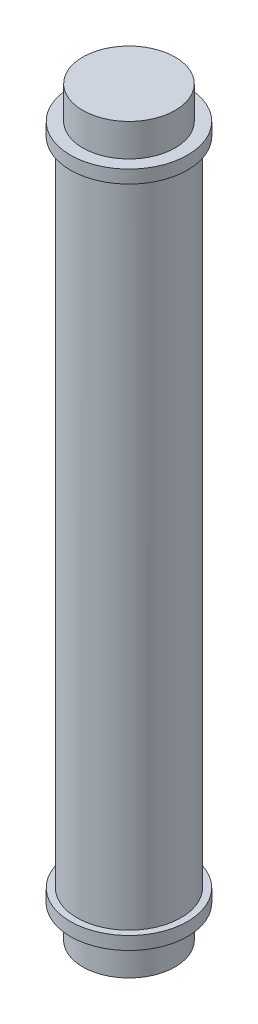
ISO-10303-21;
HEADER;
FILE_DESCRIPTION(('STEP AP214'),'2;1');
FILE_NAME('part.step','',(''),(''),'','','');
FILE_SCHEMA(('AUTOMOTIVE_DESIGN { 1 0 10303 214 1 1 1 1 }'));
ENDSEC;
DATA;
#1=APPLICATION_CONTEXT('core data for automotive mechanical design processes');
#2=APPLICATION_PROTOCOL_DEFINITION('international standard','automotive_design',2000,#1);
#3=PRODUCT_CONTEXT('',#1,'mechanical');
#4=PRODUCT('Part','Part','',(#3));
#5=PRODUCT_RELATED_PRODUCT_CATEGORY('part','',(#4));
#6=PRODUCT_DEFINITION_FORMATION('','',#4);
#7=PRODUCT_DEFINITION_CONTEXT('part definition',#1,'design');
#8=PRODUCT_DEFINITION('design','',#6,#7);
#9=PRODUCT_DEFINITION_SHAPE('','',#8);
#10=(LENGTH_UNIT() NAMED_UNIT(*) SI_UNIT(.MILLI.,.METRE.));
#11=(NAMED_UNIT(*) PLANE_ANGLE_UNIT() SI_UNIT($,.RADIAN.));
#12=(NAMED_UNIT(*) SI_UNIT($,.STERADIAN.) SOLID_ANGLE_UNIT());
#13=UNCERTAINTY_MEASURE_WITH_UNIT(LENGTH_MEASURE(1.E-05),#10,'distance_accuracy_value','');
#14=(GEOMETRIC_REPRESENTATION_CONTEXT(3) GLOBAL_UNCERTAINTY_ASSIGNED_CONTEXT((#13)) GLOBAL_UNIT_ASSIGNED_CONTEXT((#10,
#11,#12)) REPRESENTATION_CONTEXT('',''));
#15=CARTESIAN_POINT('',(0.,0.,0.));
#16=DIRECTION('',(0.,0.,1.));
#17=DIRECTION('',(1.,0.,0.));
#18=AXIS2_PLACEMENT_3D('',#15,#16,#17);
#19=CARTESIAN_POINT('',(0.,12.5,0.));
#20=DIRECTION('',(0.,-1.,0.));
#21=DIRECTION('',(0.,0.,-1.));
#22=AXIS2_PLACEMENT_3D('',#19,#20,#21);
#23=CYLINDRICAL_SURFACE('',#22,2.);
#24=CARTESIAN_POINT('',(0.,12.5,0.));
#25=DIRECTION('',(0.,1.,0.));
#26=DIRECTION('',(0.,0.,1.));
#27=AXIS2_PLACEMENT_3D('',#24,#25,#26);
#28=CIRCLE('',#27,2.);
#29=CARTESIAN_POINT('',(0.,12.5,2.));
#30=VERTEX_POINT('',#29);
#31=EDGE_CURVE('E39',#30,#30,#28,.T.);
#32=ORIENTED_EDGE('',*,*,#31,.F.);
#33=EDGE_LOOP('',(#32));
#34=FACE_BOUND('',#33,.T.);
#35=CARTESIAN_POINT('',(0.,-12.5,0.));
#36=DIRECTION('',(0.,-1.,0.));
#37=DIRECTION('',(0.,0.,-1.));
#38=AXIS2_PLACEMENT_3D('',#35,#36,#37);
#39=CIRCLE('',#38,2.);
#40=CARTESIAN_POINT('',(0.,-12.5,-2.));
#41=VERTEX_POINT('',#40);
#42=EDGE_CURVE('E62',#41,#41,#39,.T.);
#43=ORIENTED_EDGE('',*,*,#42,.F.);
#44=EDGE_LOOP('',(#43));
#45=FACE_BOUND('',#44,.T.);
#46=ADVANCED_FACE('F32',(#34,#45),#23,.T.);
#47=CARTESIAN_POINT('',(0.,13.,0.));
#48=DIRECTION('',(0.,-1.,0.));
#49=DIRECTION('',(0.,0.,-1.));
#50=AXIS2_PLACEMENT_3D('',#47,#48,#49);
#51=CYLINDRICAL_SURFACE('',#50,2.25);
#52=CARTESIAN_POINT('',(0.,13.,0.));
#53=DIRECTION('',(0.,1.,0.));
#54=DIRECTION('',(0.,0.,1.));
#55=AXIS2_PLACEMENT_3D('',#52,#53,#54);
#56=CIRCLE('',#55,2.25);
#57=CARTESIAN_POINT('',(0.,13.,2.25));
#58=VERTEX_POINT('',#57);
#59=EDGE_CURVE('E52',#58,#58,#56,.T.);
#60=ORIENTED_EDGE('',*,*,#59,.F.);
#61=EDGE_LOOP('',(#60));
#62=FACE_BOUND('',#61,.T.);
#63=CARTESIAN_POINT('',(0.,12.5,0.));
#64=DIRECTION('',(0.,1.,0.));
#65=DIRECTION('',(0.,0.,1.));
#66=AXIS2_PLACEMENT_3D('',#63,#64,#65);
#67=CIRCLE('',#66,2.25);
#68=CARTESIAN_POINT('',(0.,12.5,2.25));
#69=VERTEX_POINT('',#68);
#70=EDGE_CURVE('E53',#69,#69,#67,.T.);
#71=ORIENTED_EDGE('',*,*,#70,.T.);
#72=EDGE_LOOP('',(#71));
#73=FACE_BOUND('',#72,.T.);
#74=ADVANCED_FACE('F89',(#62,#73),#51,.T.);
#75=CARTESIAN_POINT('',(0.,13.,0.));
#76=DIRECTION('',(0.,1.,0.));
#77=DIRECTION('',(0.,0.,1.));
#78=AXIS2_PLACEMENT_3D('',#75,#76,#77);
#79=PLANE('',#78);
#80=CARTESIAN_POINT('',(0.,13.,0.));
#81=DIRECTION('',(0.,1.,0.));
#82=DIRECTION('',(0.,0.,1.));
#83=AXIS2_PLACEMENT_3D('',#80,#81,#82);
#84=CIRCLE('',#83,1.775);
#85=CARTESIAN_POINT('',(0.,13.,1.775));
#86=VERTEX_POINT('',#85);
#87=EDGE_CURVE('E59',#86,#86,#84,.T.);
#88=ORIENTED_EDGE('',*,*,#87,.F.);
#89=EDGE_LOOP('',(#88));
#90=FACE_BOUND('',#89,.T.);
#91=ORIENTED_EDGE('',*,*,#59,.T.);
#92=EDGE_LOOP('',(#91));
#93=FACE_BOUND('',#92,.T.);
#94=ADVANCED_FACE('F94',(#90,#93),#79,.T.);
#95=CARTESIAN_POINT('',(0.,12.5,0.));
#96=DIRECTION('',(0.,1.,0.));
#97=DIRECTION('',(0.,0.,1.));
#98=AXIS2_PLACEMENT_3D('',#95,#96,#97);
#99=PLANE('',#98);
#100=ORIENTED_EDGE('',*,*,#31,.T.);
#101=EDGE_LOOP('',(#100));
#102=FACE_BOUND('',#101,.T.);
#103=ORIENTED_EDGE('',*,*,#70,.F.);
#104=EDGE_LOOP('',(#103));
#105=FACE_BOUND('',#104,.T.);
#106=ADVANCED_FACE('F124',(#102,#105),#99,.F.);
#107=CARTESIAN_POINT('',(0.,14.25,0.));
#108=DIRECTION('',(0.,-1.,0.));
#109=DIRECTION('',(0.,0.,-1.));
#110=AXIS2_PLACEMENT_3D('',#107,#108,#109);
#111=CYLINDRICAL_SURFACE('',#110,1.775);
#112=CARTESIAN_POINT('',(0.,14.25,0.));
#113=DIRECTION('',(0.,1.,0.));
#114=DIRECTION('',(0.,0.,1.));
#115=AXIS2_PLACEMENT_3D('',#112,#113,#114);
#116=CIRCLE('',#115,1.775);
#117=CARTESIAN_POINT('',(0.,14.25,1.775));
#118=VERTEX_POINT('',#117);
#119=EDGE_CURVE('E56',#118,#118,#116,.T.);
#120=ORIENTED_EDGE('',*,*,#119,.F.);
#121=EDGE_LOOP('',(#120));
#122=FACE_BOUND('',#121,.T.);
#123=ORIENTED_EDGE('',*,*,#87,.T.);
#124=EDGE_LOOP('',(#123));
#125=FACE_BOUND('',#124,.T.);
#126=ADVANCED_FACE('F118',(#122,#125),#111,.T.);
#127=CARTESIAN_POINT('',(0.,14.25,0.));
#128=DIRECTION('',(0.,1.,0.));
#129=DIRECTION('',(0.,0.,1.));
#130=AXIS2_PLACEMENT_3D('',#127,#128,#129);
#131=PLANE('',#130);
#132=ORIENTED_EDGE('',*,*,#119,.T.);
#133=EDGE_LOOP('',(#132));
#134=FACE_BOUND('',#133,.T.);
#135=ADVANCED_FACE('F109',(#134),#131,.T.);
#136=CARTESIAN_POINT('',(0.,-13.,0.));
#137=DIRECTION('',(0.,1.,0.));
#138=DIRECTION('',(0.,0.,1.));
#139=AXIS2_PLACEMENT_3D('',#136,#137,#138);
#140=CYLINDRICAL_SURFACE('',#139,2.25);
#141=CARTESIAN_POINT('',(0.,-13.,0.));
#142=DIRECTION('',(0.,1.,0.));
#143=DIRECTION('',(0.,0.,1.));
#144=AXIS2_PLACEMENT_3D('',#141,#142,#143);
#145=CIRCLE('',#144,2.25);
#146=CARTESIAN_POINT('',(0.,-13.,2.25));
#147=VERTEX_POINT('',#146);
#148=EDGE_CURVE('E67',#147,#147,#145,.T.);
#149=ORIENTED_EDGE('',*,*,#148,.T.);
#150=EDGE_LOOP('',(#149));
#151=FACE_BOUND('',#150,.T.);
#152=CARTESIAN_POINT('',(0.,-12.5,0.));
#153=DIRECTION('',(0.,1.,0.));
#154=DIRECTION('',(0.,0.,1.));
#155=AXIS2_PLACEMENT_3D('',#152,#153,#154);
#156=CIRCLE('',#155,2.25);
#157=CARTESIAN_POINT('',(0.,-12.5,2.25));
#158=VERTEX_POINT('',#157);
#159=EDGE_CURVE('E68',#158,#158,#156,.T.);
#160=ORIENTED_EDGE('',*,*,#159,.F.);
#161=EDGE_LOOP('',(#160));
#162=FACE_BOUND('',#161,.T.);
#163=ADVANCED_FACE('F107',(#151,#162),#140,.T.);
#164=CARTESIAN_POINT('',(0.,-13.,0.));
#165=DIRECTION('',(0.,-1.,0.));
#166=DIRECTION('',(0.,0.,1.));
#167=AXIS2_PLACEMENT_3D('',#164,#165,#166);
#168=PLANE('',#167);
#169=CARTESIAN_POINT('',(0.,-13.,0.));
#170=DIRECTION('',(0.,-1.,0.));
#171=DIRECTION('',(0.,0.,-1.));
#172=AXIS2_PLACEMENT_3D('',#169,#170,#171);
#173=CIRCLE('',#172,1.775);
#174=CARTESIAN_POINT('',(0.,-13.,-1.775));
#175=VERTEX_POINT('',#174);
#176=EDGE_CURVE('E10',#175,#175,#173,.T.);
#177=ORIENTED_EDGE('',*,*,#176,.F.);
#178=EDGE_LOOP('',(#177));
#179=FACE_BOUND('',#178,.T.);
#180=ORIENTED_EDGE('',*,*,#148,.F.);
#181=EDGE_LOOP('',(#180));
#182=FACE_BOUND('',#181,.T.);
#183=ADVANCED_FACE('F102',(#179,#182),#168,.T.);
#184=CARTESIAN_POINT('',(0.,-12.5,0.));
#185=DIRECTION('',(0.,-1.,0.));
#186=DIRECTION('',(0.,0.,1.));
#187=AXIS2_PLACEMENT_3D('',#184,#185,#186);
#188=PLANE('',#187);
#189=ORIENTED_EDGE('',*,*,#42,.T.);
#190=EDGE_LOOP('',(#189));
#191=FACE_BOUND('',#190,.T.);
#192=ORIENTED_EDGE('',*,*,#159,.T.);
#193=EDGE_LOOP('',(#192));
#194=FACE_BOUND('',#193,.T.);
#195=ADVANCED_FACE('F86',(#191,#194),#188,.F.);
#196=CARTESIAN_POINT('',(0.,-14.25,0.));
#197=DIRECTION('',(0.,1.,0.));
#198=DIRECTION('',(0.,0.,1.));
#199=AXIS2_PLACEMENT_3D('',#196,#197,#198);
#200=CYLINDRICAL_SURFACE('',#199,1.775);
#201=CARTESIAN_POINT('',(0.,-14.25,0.));
#202=DIRECTION('',(0.,1.,0.));
#203=DIRECTION('',(0.,0.,1.));
#204=AXIS2_PLACEMENT_3D('',#201,#202,#203);
#205=CIRCLE('',#204,1.775);
#206=CARTESIAN_POINT('',(0.,-14.25,1.775));
#207=VERTEX_POINT('',#206);
#208=EDGE_CURVE('E71',#207,#207,#205,.T.);
#209=ORIENTED_EDGE('',*,*,#208,.T.);
#210=EDGE_LOOP('',(#209));
#211=FACE_BOUND('',#210,.T.);
#212=ORIENTED_EDGE('',*,*,#176,.T.);
#213=EDGE_LOOP('',(#212));
#214=FACE_BOUND('',#213,.T.);
#215=ADVANCED_FACE('F77',(#211,#214),#200,.T.);
#216=CARTESIAN_POINT('',(0.,-14.25,0.));
#217=DIRECTION('',(0.,-1.,0.));
#218=DIRECTION('',(0.,0.,1.));
#219=AXIS2_PLACEMENT_3D('',#216,#217,#218);
#220=PLANE('',#219);
#221=ORIENTED_EDGE('',*,*,#208,.F.);
#222=EDGE_LOOP('',(#221));
#223=FACE_BOUND('',#222,.T.);
#224=ADVANCED_FACE('F79',(#223),#220,.T.);
#225=CLOSED_SHELL('',(#46,#74,#94,#106,#126,#135,#163,#183,#195,#215,#224));
#226=CARTESIAN_POINT('',(0.,-12.5,0.));
#227=DIRECTION('',(0.,1.,0.));
#228=DIRECTION('',(0.,0.,1.));
#229=AXIS2_PLACEMENT_3D('',#226,#227,#228);
#230=CIRCLE('',#229,1.5);
#231=CARTESIAN_POINT('',(0.,-12.5,1.5));
#232=VERTEX_POINT('',#231);
#233=EDGE_CURVE('E43',#232,#232,#230,.T.);
#234=ORIENTED_EDGE('',*,*,#233,.T.);
#235=EDGE_LOOP('',(#234));
#236=FACE_BOUND('',#235,.T.);
#237=ADVANCED_FACE('F104',(#236),#188,.F.);
#238=CARTESIAN_POINT('',(0.,12.5,0.));
#239=DIRECTION('',(0.,1.,0.));
#240=DIRECTION('',(0.,0.,1.));
#241=AXIS2_PLACEMENT_3D('',#238,#239,#240);
#242=CIRCLE('',#241,1.5);
#243=CARTESIAN_POINT('',(0.,12.5,1.5));
#244=VERTEX_POINT('',#243);
#245=EDGE_CURVE('E47',#244,#244,#242,.T.);
#246=ORIENTED_EDGE('',*,*,#245,.F.);
#247=EDGE_LOOP('',(#246));
#248=FACE_BOUND('',#247,.T.);
#249=ADVANCED_FACE('F130',(#248),#99,.F.);
#250=CARTESIAN_POINT('',(0.,12.5,0.));
#251=DIRECTION('',(0.,-1.,0.));
#252=DIRECTION('',(0.,0.,-1.));
#253=AXIS2_PLACEMENT_3D('',#250,#251,#252);
#254=CYLINDRICAL_SURFACE('',#253,1.5);
#255=ORIENTED_EDGE('',*,*,#245,.T.);
#256=EDGE_LOOP('',(#255));
#257=FACE_BOUND('',#256,.T.);
#258=ORIENTED_EDGE('',*,*,#233,.F.);
#259=EDGE_LOOP('',(#258));
#260=FACE_BOUND('',#259,.T.);
#261=ADVANCED_FACE('F131',(#257,#260),#254,.F.);
#262=CLOSED_SHELL('',(#237,#249,#261));
#263=ORIENTED_CLOSED_SHELL('',*,#262,.T.);
#264=BREP_WITH_VOIDS('B2',#225,(#263));
#265=ADVANCED_BREP_SHAPE_REPRESENTATION('',(#18,#264),#14);
#266=SHAPE_DEFINITION_REPRESENTATION(#9,#265);
ENDSEC;
END-ISO-10303-21;
